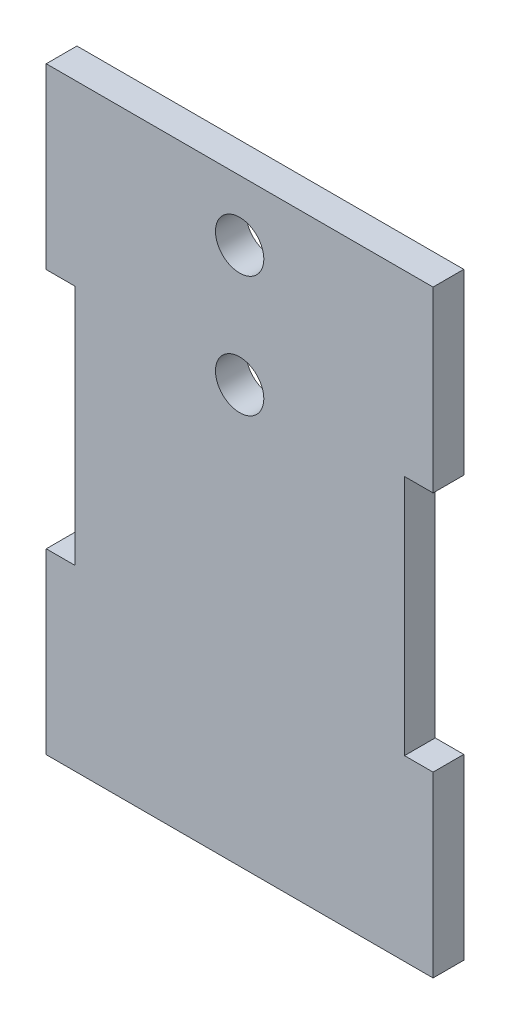
ISO-10303-21;
HEADER;
FILE_DESCRIPTION(('STEP AP214'),'2;1');
FILE_NAME('part.step','',(''),(''),'','','');
FILE_SCHEMA(('AUTOMOTIVE_DESIGN { 1 0 10303 214 1 1 1 1 }'));
ENDSEC;
DATA;
#1=APPLICATION_CONTEXT('core data for automotive mechanical design processes');
#2=APPLICATION_PROTOCOL_DEFINITION('international standard','automotive_design',2000,#1);
#3=PRODUCT_CONTEXT('',#1,'mechanical');
#4=PRODUCT('Part','Part','',(#3));
#5=PRODUCT_RELATED_PRODUCT_CATEGORY('part','',(#4));
#6=PRODUCT_DEFINITION_FORMATION('','',#4);
#7=PRODUCT_DEFINITION_CONTEXT('part definition',#1,'design');
#8=PRODUCT_DEFINITION('design','',#6,#7);
#9=PRODUCT_DEFINITION_SHAPE('','',#8);
#10=(LENGTH_UNIT() NAMED_UNIT(*) SI_UNIT(.MILLI.,.METRE.));
#11=(NAMED_UNIT(*) PLANE_ANGLE_UNIT() SI_UNIT($,.RADIAN.));
#12=(NAMED_UNIT(*) SI_UNIT($,.STERADIAN.) SOLID_ANGLE_UNIT());
#13=UNCERTAINTY_MEASURE_WITH_UNIT(LENGTH_MEASURE(1.E-05),#10,'distance_accuracy_value','');
#14=(GEOMETRIC_REPRESENTATION_CONTEXT(3) GLOBAL_UNCERTAINTY_ASSIGNED_CONTEXT((#13)) GLOBAL_UNIT_ASSIGNED_CONTEXT((#10,
#11,#12)) REPRESENTATION_CONTEXT('',''));
#15=CARTESIAN_POINT('',(0.,0.,0.));
#16=DIRECTION('',(0.,0.,1.));
#17=DIRECTION('',(1.,0.,0.));
#18=AXIS2_PLACEMENT_3D('',#15,#16,#17);
#19=CARTESIAN_POINT('',(0.,0.,2.54));
#20=DIRECTION('',(0.,0.,-1.));
#21=DIRECTION('',(-1.,0.,0.));
#22=AXIS2_PLACEMENT_3D('',#19,#20,#21);
#23=PLANE('',#22);
#24=DIRECTION('',(0.,1.,0.));
#25=VECTOR('',#24,1.);
#26=CARTESIAN_POINT('',(16.,9.99999999999998,2.54));
#27=LINE('',#26,#25);
#28=CARTESIAN_POINT('',(16.,9.99999999999998,2.54));
#29=VERTEX_POINT('',#28);
#30=CARTESIAN_POINT('',(16.,24.75,2.54));
#31=VERTEX_POINT('',#30);
#32=EDGE_CURVE('E177',#29,#31,#27,.T.);
#33=ORIENTED_EDGE('',*,*,#32,.T.);
#34=DIRECTION('',(-1.,0.,0.));
#35=VECTOR('',#34,1.);
#36=CARTESIAN_POINT('',(-16.,24.75,2.54));
#37=LINE('',#36,#35);
#38=CARTESIAN_POINT('',(-16.,24.75,2.54));
#39=VERTEX_POINT('',#38);
#40=EDGE_CURVE('E105',#31,#39,#37,.T.);
#41=ORIENTED_EDGE('',*,*,#40,.T.);
#42=DIRECTION('',(0.,-1.,0.));
#43=VECTOR('',#42,1.);
#44=CARTESIAN_POINT('',(-16.,9.99999999999998,2.54));
#45=LINE('',#44,#43);
#46=CARTESIAN_POINT('',(-16.,9.99999999999998,2.54));
#47=VERTEX_POINT('',#46);
#48=EDGE_CURVE('E204',#39,#47,#45,.T.);
#49=ORIENTED_EDGE('',*,*,#48,.T.);
#50=DIRECTION('',(1.,0.,0.));
#51=VECTOR('',#50,1.);
#52=CARTESIAN_POINT('',(-16.,9.99999999999998,2.54));
#53=LINE('',#52,#51);
#54=CARTESIAN_POINT('',(-13.64,9.99999999999998,2.54));
#55=VERTEX_POINT('',#54);
#56=EDGE_CURVE('E223',#47,#55,#53,.T.);
#57=ORIENTED_EDGE('',*,*,#56,.T.);
#58=DIRECTION('',(0.,-1.,0.));
#59=VECTOR('',#58,1.);
#60=CARTESIAN_POINT('',(-13.64,9.99999999999998,2.54));
#61=LINE('',#60,#59);
#62=CARTESIAN_POINT('',(-13.64,-10.,2.54));
#63=VERTEX_POINT('',#62);
#64=EDGE_CURVE('E220',#55,#63,#61,.T.);
#65=ORIENTED_EDGE('',*,*,#64,.T.);
#66=DIRECTION('',(-1.,0.,0.));
#67=VECTOR('',#66,1.);
#68=CARTESIAN_POINT('',(-16.,-10.,2.54));
#69=LINE('',#68,#67);
#70=CARTESIAN_POINT('',(-16.,-10.,2.54));
#71=VERTEX_POINT('',#70);
#72=EDGE_CURVE('E222',#63,#71,#69,.T.);
#73=ORIENTED_EDGE('',*,*,#72,.T.);
#74=DIRECTION('',(0.,-1.,0.));
#75=VECTOR('',#74,1.);
#76=CARTESIAN_POINT('',(-16.,-24.75,2.54));
#77=LINE('',#76,#75);
#78=CARTESIAN_POINT('',(-16.,-24.75,2.54));
#79=VERTEX_POINT('',#78);
#80=EDGE_CURVE('E225',#71,#79,#77,.T.);
#81=ORIENTED_EDGE('',*,*,#80,.T.);
#82=DIRECTION('',(1.,0.,0.));
#83=VECTOR('',#82,1.);
#84=CARTESIAN_POINT('',(-16.,-24.75,2.54));
#85=LINE('',#84,#83);
#86=CARTESIAN_POINT('',(16.,-24.75,2.54));
#87=VERTEX_POINT('',#86);
#88=EDGE_CURVE('E231',#79,#87,#85,.T.);
#89=ORIENTED_EDGE('',*,*,#88,.T.);
#90=DIRECTION('',(0.,1.,0.));
#91=VECTOR('',#90,1.);
#92=CARTESIAN_POINT('',(16.,-24.75,2.54));
#93=LINE('',#92,#91);
#94=CARTESIAN_POINT('',(16.,-10.,2.54));
#95=VERTEX_POINT('',#94);
#96=EDGE_CURVE('E136',#87,#95,#93,.T.);
#97=ORIENTED_EDGE('',*,*,#96,.T.);
#98=DIRECTION('',(-1.,0.,0.));
#99=VECTOR('',#98,1.);
#100=CARTESIAN_POINT('',(16.,-10.,2.54));
#101=LINE('',#100,#99);
#102=CARTESIAN_POINT('',(13.64,-10.,2.54));
#103=VERTEX_POINT('',#102);
#104=EDGE_CURVE('E130',#95,#103,#101,.T.);
#105=ORIENTED_EDGE('',*,*,#104,.T.);
#106=DIRECTION('',(0.,1.,0.));
#107=VECTOR('',#106,1.);
#108=CARTESIAN_POINT('',(13.64,9.99999999999998,2.54));
#109=LINE('',#108,#107);
#110=CARTESIAN_POINT('',(13.64,9.99999999999998,2.54));
#111=VERTEX_POINT('',#110);
#112=EDGE_CURVE('E134',#103,#111,#109,.T.);
#113=ORIENTED_EDGE('',*,*,#112,.T.);
#114=DIRECTION('',(1.,0.,0.));
#115=VECTOR('',#114,1.);
#116=CARTESIAN_POINT('',(16.,9.99999999999998,2.54));
#117=LINE('',#116,#115);
#118=EDGE_CURVE('E50',#111,#29,#117,.T.);
#119=ORIENTED_EDGE('',*,*,#118,.T.);
#120=EDGE_LOOP('',(#33,#41,#49,#57,#65,#73,#81,#89,#97,#105,#113,#119));
#121=FACE_BOUND('',#120,.T.);
#122=CARTESIAN_POINT('',(0.,9.75,2.54));
#123=DIRECTION('',(0.,0.,1.));
#124=DIRECTION('',(1.,0.,0.));
#125=AXIS2_PLACEMENT_3D('',#122,#123,#124);
#126=CIRCLE('',#125,2.);
#127=CARTESIAN_POINT('',(2.,9.75,2.54));
#128=VERTEX_POINT('',#127);
#129=EDGE_CURVE('E158',#128,#128,#126,.T.);
#130=ORIENTED_EDGE('',*,*,#129,.F.);
#131=EDGE_LOOP('',(#130));
#132=FACE_BOUND('',#131,.T.);
#133=CARTESIAN_POINT('',(0.,19.75,2.54));
#134=DIRECTION('',(0.,0.,1.));
#135=DIRECTION('',(1.,0.,0.));
#136=AXIS2_PLACEMENT_3D('',#133,#134,#135);
#137=CIRCLE('',#136,2.);
#138=CARTESIAN_POINT('',(2.,19.75,2.54));
#139=VERTEX_POINT('',#138);
#140=EDGE_CURVE('E272',#139,#139,#137,.T.);
#141=ORIENTED_EDGE('',*,*,#140,.F.);
#142=EDGE_LOOP('',(#141));
#143=FACE_BOUND('',#142,.T.);
#144=ADVANCED_FACE('F33',(#121,#132,#143),#23,.F.);
#145=CARTESIAN_POINT('',(0.,0.,0.));
#146=DIRECTION('',(0.,0.,-1.));
#147=DIRECTION('',(-1.,0.,0.));
#148=AXIS2_PLACEMENT_3D('',#145,#146,#147);
#149=PLANE('',#148);
#150=CARTESIAN_POINT('',(0.,9.75,0.));
#151=DIRECTION('',(0.,0.,1.));
#152=DIRECTION('',(1.,0.,0.));
#153=AXIS2_PLACEMENT_3D('',#150,#151,#152);
#154=CIRCLE('',#153,2.);
#155=CARTESIAN_POINT('',(2.,9.75,0.));
#156=VERTEX_POINT('',#155);
#157=EDGE_CURVE('E277',#156,#156,#154,.T.);
#158=ORIENTED_EDGE('',*,*,#157,.T.);
#159=EDGE_LOOP('',(#158));
#160=FACE_BOUND('',#159,.T.);
#161=DIRECTION('',(0.,1.,0.));
#162=VECTOR('',#161,1.);
#163=CARTESIAN_POINT('',(16.,9.99999999999998,0.));
#164=LINE('',#163,#162);
#165=CARTESIAN_POINT('',(16.,9.99999999999998,0.));
#166=VERTEX_POINT('',#165);
#167=CARTESIAN_POINT('',(16.,24.75,0.));
#168=VERTEX_POINT('',#167);
#169=EDGE_CURVE('E154',#166,#168,#164,.T.);
#170=ORIENTED_EDGE('',*,*,#169,.F.);
#171=DIRECTION('',(1.,0.,0.));
#172=VECTOR('',#171,1.);
#173=CARTESIAN_POINT('',(16.,9.99999999999998,0.));
#174=LINE('',#173,#172);
#175=CARTESIAN_POINT('',(13.64,9.99999999999998,0.));
#176=VERTEX_POINT('',#175);
#177=EDGE_CURVE('E97',#176,#166,#174,.T.);
#178=ORIENTED_EDGE('',*,*,#177,.F.);
#179=DIRECTION('',(0.,1.,0.));
#180=VECTOR('',#179,1.);
#181=CARTESIAN_POINT('',(13.64,9.99999999999998,0.));
#182=LINE('',#181,#180);
#183=CARTESIAN_POINT('',(13.64,-10.,0.));
#184=VERTEX_POINT('',#183);
#185=EDGE_CURVE('E91',#184,#176,#182,.T.);
#186=ORIENTED_EDGE('',*,*,#185,.F.);
#187=DIRECTION('',(-1.,0.,0.));
#188=VECTOR('',#187,1.);
#189=CARTESIAN_POINT('',(16.,-10.,0.));
#190=LINE('',#189,#188);
#191=CARTESIAN_POINT('',(16.,-10.,0.));
#192=VERTEX_POINT('',#191);
#193=EDGE_CURVE('E144',#192,#184,#190,.T.);
#194=ORIENTED_EDGE('',*,*,#193,.F.);
#195=DIRECTION('',(0.,1.,0.));
#196=VECTOR('',#195,1.);
#197=CARTESIAN_POINT('',(16.,-24.75,0.));
#198=LINE('',#197,#196);
#199=CARTESIAN_POINT('',(16.,-24.75,0.));
#200=VERTEX_POINT('',#199);
#201=EDGE_CURVE('E172',#200,#192,#198,.T.);
#202=ORIENTED_EDGE('',*,*,#201,.F.);
#203=DIRECTION('',(1.,0.,0.));
#204=VECTOR('',#203,1.);
#205=CARTESIAN_POINT('',(-16.,-24.75,0.));
#206=LINE('',#205,#204);
#207=CARTESIAN_POINT('',(-16.,-24.75,0.));
#208=VERTEX_POINT('',#207);
#209=EDGE_CURVE('E170',#208,#200,#206,.T.);
#210=ORIENTED_EDGE('',*,*,#209,.F.);
#211=DIRECTION('',(0.,-1.,0.));
#212=VECTOR('',#211,1.);
#213=CARTESIAN_POINT('',(-16.,-24.75,0.));
#214=LINE('',#213,#212);
#215=CARTESIAN_POINT('',(-16.,-10.,0.));
#216=VERTEX_POINT('',#215);
#217=EDGE_CURVE('E168',#216,#208,#214,.T.);
#218=ORIENTED_EDGE('',*,*,#217,.F.);
#219=DIRECTION('',(-1.,0.,0.));
#220=VECTOR('',#219,1.);
#221=CARTESIAN_POINT('',(-16.,-10.,0.));
#222=LINE('',#221,#220);
#223=CARTESIAN_POINT('',(-13.64,-10.,0.));
#224=VERTEX_POINT('',#223);
#225=EDGE_CURVE('E166',#224,#216,#222,.T.);
#226=ORIENTED_EDGE('',*,*,#225,.F.);
#227=DIRECTION('',(0.,-1.,0.));
#228=VECTOR('',#227,1.);
#229=CARTESIAN_POINT('',(-13.64,9.99999999999998,0.));
#230=LINE('',#229,#228);
#231=CARTESIAN_POINT('',(-13.64,9.99999999999998,0.));
#232=VERTEX_POINT('',#231);
#233=EDGE_CURVE('E164',#232,#224,#230,.T.);
#234=ORIENTED_EDGE('',*,*,#233,.F.);
#235=DIRECTION('',(1.,0.,0.));
#236=VECTOR('',#235,1.);
#237=CARTESIAN_POINT('',(-16.,9.99999999999998,0.));
#238=LINE('',#237,#236);
#239=CARTESIAN_POINT('',(-16.,9.99999999999998,0.));
#240=VERTEX_POINT('',#239);
#241=EDGE_CURVE('E162',#240,#232,#238,.T.);
#242=ORIENTED_EDGE('',*,*,#241,.F.);
#243=DIRECTION('',(0.,-1.,0.));
#244=VECTOR('',#243,1.);
#245=CARTESIAN_POINT('',(-16.,9.99999999999998,0.));
#246=LINE('',#245,#244);
#247=CARTESIAN_POINT('',(-16.,24.75,0.));
#248=VERTEX_POINT('',#247);
#249=EDGE_CURVE('E160',#248,#240,#246,.T.);
#250=ORIENTED_EDGE('',*,*,#249,.F.);
#251=DIRECTION('',(-1.,0.,0.));
#252=VECTOR('',#251,1.);
#253=CARTESIAN_POINT('',(-16.,24.75,0.));
#254=LINE('',#253,#252);
#255=EDGE_CURVE('E157',#168,#248,#254,.T.);
#256=ORIENTED_EDGE('',*,*,#255,.F.);
#257=EDGE_LOOP('',(#170,#178,#186,#194,#202,#210,#218,#226,#234,#242,#250,#256));
#258=FACE_BOUND('',#257,.T.);
#259=CARTESIAN_POINT('',(0.,19.75,0.));
#260=DIRECTION('',(0.,0.,1.));
#261=DIRECTION('',(1.,0.,0.));
#262=AXIS2_PLACEMENT_3D('',#259,#260,#261);
#263=CIRCLE('',#262,2.);
#264=CARTESIAN_POINT('',(2.,19.75,0.));
#265=VERTEX_POINT('',#264);
#266=EDGE_CURVE('E275',#265,#265,#263,.T.);
#267=ORIENTED_EDGE('',*,*,#266,.T.);
#268=EDGE_LOOP('',(#267));
#269=FACE_BOUND('',#268,.T.);
#270=ADVANCED_FACE('F208',(#160,#258,#269),#149,.T.);
#271=CARTESIAN_POINT('',(16.,9.99999999999998,2.54));
#272=DIRECTION('',(-1.,0.,0.));
#273=DIRECTION('',(0.,-1.,0.));
#274=AXIS2_PLACEMENT_3D('',#271,#272,#273);
#275=PLANE('',#274);
#276=ORIENTED_EDGE('',*,*,#169,.T.);
#277=DIRECTION('',(0.,0.,-1.));
#278=VECTOR('',#277,1.);
#279=CARTESIAN_POINT('',(16.,24.75,2.54));
#280=LINE('',#279,#278);
#281=EDGE_CURVE('E11',#31,#168,#280,.T.);
#282=ORIENTED_EDGE('',*,*,#281,.F.);
#283=ORIENTED_EDGE('',*,*,#32,.F.);
#284=DIRECTION('',(0.,0.,-1.));
#285=VECTOR('',#284,1.);
#286=CARTESIAN_POINT('',(16.,9.99999999999998,2.54));
#287=LINE('',#286,#285);
#288=EDGE_CURVE('E150',#29,#166,#287,.T.);
#289=ORIENTED_EDGE('',*,*,#288,.T.);
#290=EDGE_LOOP('',(#276,#282,#283,#289));
#291=FACE_BOUND('',#290,.T.);
#292=ADVANCED_FACE('F35',(#291),#275,.F.);
#293=CARTESIAN_POINT('',(-16.,24.75,2.54));
#294=DIRECTION('',(0.,-1.,0.));
#295=DIRECTION('',(1.,0.,0.));
#296=AXIS2_PLACEMENT_3D('',#293,#294,#295);
#297=PLANE('',#296);
#298=ORIENTED_EDGE('',*,*,#255,.T.);
#299=DIRECTION('',(0.,0.,-1.));
#300=VECTOR('',#299,1.);
#301=CARTESIAN_POINT('',(-16.,24.75,2.54));
#302=LINE('',#301,#300);
#303=EDGE_CURVE('E42',#39,#248,#302,.T.);
#304=ORIENTED_EDGE('',*,*,#303,.F.);
#305=ORIENTED_EDGE('',*,*,#40,.F.);
#306=ORIENTED_EDGE('',*,*,#281,.T.);
#307=EDGE_LOOP('',(#298,#304,#305,#306));
#308=FACE_BOUND('',#307,.T.);
#309=ADVANCED_FACE('F372',(#308),#297,.F.);
#310=CARTESIAN_POINT('',(-16.,9.99999999999998,2.54));
#311=DIRECTION('',(1.,0.,0.));
#312=DIRECTION('',(0.,1.,0.));
#313=AXIS2_PLACEMENT_3D('',#310,#311,#312);
#314=PLANE('',#313);
#315=ORIENTED_EDGE('',*,*,#249,.T.);
#316=DIRECTION('',(0.,0.,-1.));
#317=VECTOR('',#316,1.);
#318=CARTESIAN_POINT('',(-16.,9.99999999999998,2.54));
#319=LINE('',#318,#317);
#320=EDGE_CURVE('E196',#47,#240,#319,.T.);
#321=ORIENTED_EDGE('',*,*,#320,.F.);
#322=ORIENTED_EDGE('',*,*,#48,.F.);
#323=ORIENTED_EDGE('',*,*,#303,.T.);
#324=EDGE_LOOP('',(#315,#321,#322,#323));
#325=FACE_BOUND('',#324,.T.);
#326=ADVANCED_FACE('F202',(#325),#314,.F.);
#327=CARTESIAN_POINT('',(-16.,9.99999999999998,2.54));
#328=DIRECTION('',(0.,1.,0.));
#329=DIRECTION('',(0.,0.,1.));
#330=AXIS2_PLACEMENT_3D('',#327,#328,#329);
#331=PLANE('',#330);
#332=ORIENTED_EDGE('',*,*,#241,.T.);
#333=DIRECTION('',(0.,0.,-1.));
#334=VECTOR('',#333,1.);
#335=CARTESIAN_POINT('',(-13.64,9.99999999999998,2.54));
#336=LINE('',#335,#334);
#337=EDGE_CURVE('E193',#55,#232,#336,.T.);
#338=ORIENTED_EDGE('',*,*,#337,.F.);
#339=ORIENTED_EDGE('',*,*,#56,.F.);
#340=ORIENTED_EDGE('',*,*,#320,.T.);
#341=EDGE_LOOP('',(#332,#338,#339,#340));
#342=FACE_BOUND('',#341,.T.);
#343=ADVANCED_FACE('F214',(#342),#331,.F.);
#344=CARTESIAN_POINT('',(-13.64,9.99999999999998,2.54));
#345=DIRECTION('',(1.,0.,0.));
#346=DIRECTION('',(0.,1.,0.));
#347=AXIS2_PLACEMENT_3D('',#344,#345,#346);
#348=PLANE('',#347);
#349=ORIENTED_EDGE('',*,*,#233,.T.);
#350=DIRECTION('',(0.,0.,-1.));
#351=VECTOR('',#350,1.);
#352=CARTESIAN_POINT('',(-13.64,-10.,2.54));
#353=LINE('',#352,#351);
#354=EDGE_CURVE('E190',#63,#224,#353,.T.);
#355=ORIENTED_EDGE('',*,*,#354,.F.);
#356=ORIENTED_EDGE('',*,*,#64,.F.);
#357=ORIENTED_EDGE('',*,*,#337,.T.);
#358=EDGE_LOOP('',(#349,#355,#356,#357));
#359=FACE_BOUND('',#358,.T.);
#360=ADVANCED_FACE('F218',(#359),#348,.F.);
#361=CARTESIAN_POINT('',(-16.,-10.,2.54));
#362=DIRECTION('',(0.,-1.,0.));
#363=DIRECTION('',(0.,0.,-1.));
#364=AXIS2_PLACEMENT_3D('',#361,#362,#363);
#365=PLANE('',#364);
#366=ORIENTED_EDGE('',*,*,#225,.T.);
#367=DIRECTION('',(0.,0.,-1.));
#368=VECTOR('',#367,1.);
#369=CARTESIAN_POINT('',(-16.,-10.,2.54));
#370=LINE('',#369,#368);
#371=EDGE_CURVE('E187',#71,#216,#370,.T.);
#372=ORIENTED_EDGE('',*,*,#371,.F.);
#373=ORIENTED_EDGE('',*,*,#72,.F.);
#374=ORIENTED_EDGE('',*,*,#354,.T.);
#375=EDGE_LOOP('',(#366,#372,#373,#374));
#376=FACE_BOUND('',#375,.T.);
#377=ADVANCED_FACE('F337',(#376),#365,.F.);
#378=CARTESIAN_POINT('',(-16.,-24.75,2.54));
#379=DIRECTION('',(1.,0.,0.));
#380=DIRECTION('',(0.,0.,-1.));
#381=AXIS2_PLACEMENT_3D('',#378,#379,#380);
#382=PLANE('',#381);
#383=ORIENTED_EDGE('',*,*,#217,.T.);
#384=DIRECTION('',(0.,0.,-1.));
#385=VECTOR('',#384,1.);
#386=CARTESIAN_POINT('',(-16.,-24.75,2.54));
#387=LINE('',#386,#385);
#388=EDGE_CURVE('E184',#79,#208,#387,.T.);
#389=ORIENTED_EDGE('',*,*,#388,.F.);
#390=ORIENTED_EDGE('',*,*,#80,.F.);
#391=ORIENTED_EDGE('',*,*,#371,.T.);
#392=EDGE_LOOP('',(#383,#389,#390,#391));
#393=FACE_BOUND('',#392,.T.);
#394=ADVANCED_FACE('F328',(#393),#382,.F.);
#395=CARTESIAN_POINT('',(-16.,-24.75,2.54));
#396=DIRECTION('',(0.,1.,0.));
#397=DIRECTION('',(0.,0.,1.));
#398=AXIS2_PLACEMENT_3D('',#395,#396,#397);
#399=PLANE('',#398);
#400=ORIENTED_EDGE('',*,*,#209,.T.);
#401=DIRECTION('',(0.,0.,-1.));
#402=VECTOR('',#401,1.);
#403=CARTESIAN_POINT('',(16.,-24.75,2.54));
#404=LINE('',#403,#402);
#405=EDGE_CURVE('E181',#87,#200,#404,.T.);
#406=ORIENTED_EDGE('',*,*,#405,.F.);
#407=ORIENTED_EDGE('',*,*,#88,.F.);
#408=ORIENTED_EDGE('',*,*,#388,.T.);
#409=EDGE_LOOP('',(#400,#406,#407,#408));
#410=FACE_BOUND('',#409,.T.);
#411=ADVANCED_FACE('F237',(#410),#399,.F.);
#412=CARTESIAN_POINT('',(16.,-24.75,2.54));
#413=DIRECTION('',(-1.,0.,0.));
#414=DIRECTION('',(0.,0.,1.));
#415=AXIS2_PLACEMENT_3D('',#412,#413,#414);
#416=PLANE('',#415);
#417=ORIENTED_EDGE('',*,*,#201,.T.);
#418=DIRECTION('',(0.,0.,-1.));
#419=VECTOR('',#418,1.);
#420=CARTESIAN_POINT('',(16.,-10.,2.54));
#421=LINE('',#420,#419);
#422=EDGE_CURVE('E145',#95,#192,#421,.T.);
#423=ORIENTED_EDGE('',*,*,#422,.F.);
#424=ORIENTED_EDGE('',*,*,#96,.F.);
#425=ORIENTED_EDGE('',*,*,#405,.T.);
#426=EDGE_LOOP('',(#417,#423,#424,#425));
#427=FACE_BOUND('',#426,.T.);
#428=ADVANCED_FACE('F241',(#427),#416,.F.);
#429=CARTESIAN_POINT('',(16.,-10.,2.54));
#430=DIRECTION('',(0.,-1.,0.));
#431=DIRECTION('',(0.,0.,-1.));
#432=AXIS2_PLACEMENT_3D('',#429,#430,#431);
#433=PLANE('',#432);
#434=ORIENTED_EDGE('',*,*,#193,.T.);
#435=DIRECTION('',(0.,0.,-1.));
#436=VECTOR('',#435,1.);
#437=CARTESIAN_POINT('',(13.64,-10.,2.54));
#438=LINE('',#437,#436);
#439=EDGE_CURVE('E141',#103,#184,#438,.T.);
#440=ORIENTED_EDGE('',*,*,#439,.F.);
#441=ORIENTED_EDGE('',*,*,#104,.F.);
#442=ORIENTED_EDGE('',*,*,#422,.T.);
#443=EDGE_LOOP('',(#434,#440,#441,#442));
#444=FACE_BOUND('',#443,.T.);
#445=ADVANCED_FACE('F142',(#444),#433,.F.);
#446=CARTESIAN_POINT('',(13.64,9.99999999999998,2.54));
#447=DIRECTION('',(-1.,0.,0.));
#448=DIRECTION('',(0.,-1.,0.));
#449=AXIS2_PLACEMENT_3D('',#446,#447,#448);
#450=PLANE('',#449);
#451=ORIENTED_EDGE('',*,*,#185,.T.);
#452=DIRECTION('',(0.,0.,-1.));
#453=VECTOR('',#452,1.);
#454=CARTESIAN_POINT('',(13.64,9.99999999999998,2.54));
#455=LINE('',#454,#453);
#456=EDGE_CURVE('E146',#111,#176,#455,.T.);
#457=ORIENTED_EDGE('',*,*,#456,.F.);
#458=ORIENTED_EDGE('',*,*,#112,.F.);
#459=ORIENTED_EDGE('',*,*,#439,.T.);
#460=EDGE_LOOP('',(#451,#457,#458,#459));
#461=FACE_BOUND('',#460,.T.);
#462=ADVANCED_FACE('F148',(#461),#450,.F.);
#463=CARTESIAN_POINT('',(16.,9.99999999999998,2.54));
#464=DIRECTION('',(0.,1.,0.));
#465=DIRECTION('',(0.,0.,1.));
#466=AXIS2_PLACEMENT_3D('',#463,#464,#465);
#467=PLANE('',#466);
#468=ORIENTED_EDGE('',*,*,#177,.T.);
#469=ORIENTED_EDGE('',*,*,#288,.F.);
#470=ORIENTED_EDGE('',*,*,#118,.F.);
#471=ORIENTED_EDGE('',*,*,#456,.T.);
#472=EDGE_LOOP('',(#468,#469,#470,#471));
#473=FACE_BOUND('',#472,.T.);
#474=ADVANCED_FACE('F245',(#473),#467,.F.);
#475=CARTESIAN_POINT('',(0.,9.75,2.54));
#476=DIRECTION('',(0.,0.,-1.));
#477=DIRECTION('',(-1.,0.,0.));
#478=AXIS2_PLACEMENT_3D('',#475,#476,#477);
#479=CYLINDRICAL_SURFACE('',#478,2.);
#480=ORIENTED_EDGE('',*,*,#129,.T.);
#481=EDGE_LOOP('',(#480));
#482=FACE_BOUND('',#481,.T.);
#483=ORIENTED_EDGE('',*,*,#157,.F.);
#484=EDGE_LOOP('',(#483));
#485=FACE_BOUND('',#484,.T.);
#486=ADVANCED_FACE('F247',(#482,#485),#479,.F.);
#487=CARTESIAN_POINT('',(0.,19.75,2.54));
#488=DIRECTION('',(0.,0.,-1.));
#489=DIRECTION('',(-1.,0.,0.));
#490=AXIS2_PLACEMENT_3D('',#487,#488,#489);
#491=CYLINDRICAL_SURFACE('',#490,2.);
#492=ORIENTED_EDGE('',*,*,#140,.T.);
#493=EDGE_LOOP('',(#492));
#494=FACE_BOUND('',#493,.T.);
#495=ORIENTED_EDGE('',*,*,#266,.F.);
#496=EDGE_LOOP('',(#495));
#497=FACE_BOUND('',#496,.T.);
#498=ADVANCED_FACE('F253',(#494,#497),#491,.F.);
#499=CLOSED_SHELL('',(#144,#270,#292,#309,#326,#343,#360,#377,#394,#411,#428,#445,#462,#474,
#486,#498));
#500=MANIFOLD_SOLID_BREP('B2',#499);
#501=ADVANCED_BREP_SHAPE_REPRESENTATION('',(#18,#500),#14);
#502=SHAPE_DEFINITION_REPRESENTATION(#9,#501);
ENDSEC;
END-ISO-10303-21;
